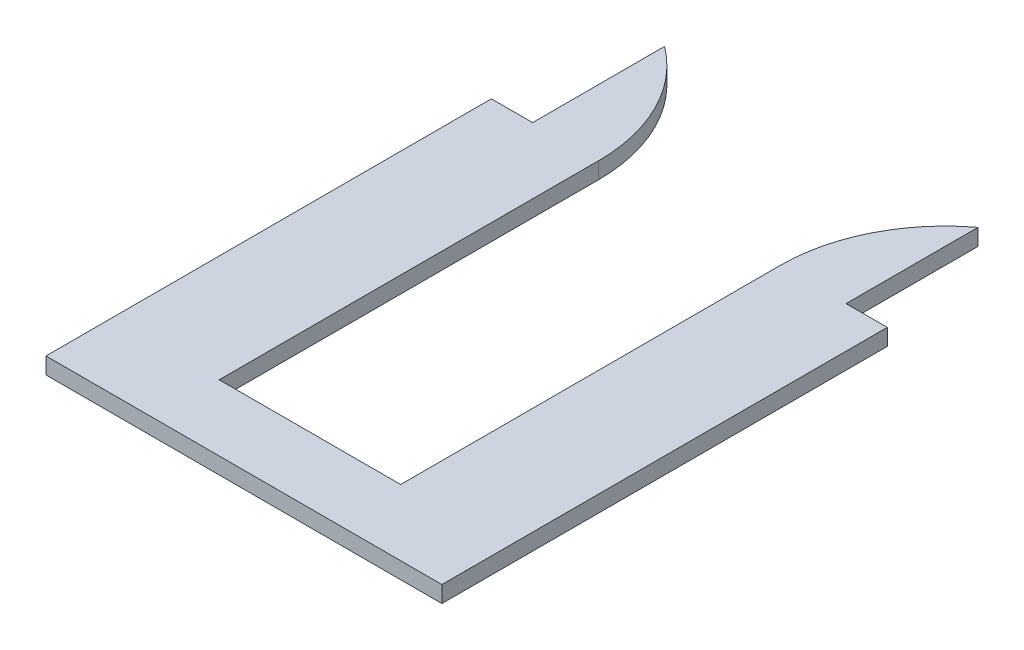
ISO-10303-21;
HEADER;
FILE_DESCRIPTION(('STEP AP214'),'2;1');
FILE_NAME('part.step','',(''),(''),'','','');
FILE_SCHEMA(('AUTOMOTIVE_DESIGN { 1 0 10303 214 1 1 1 1 }'));
ENDSEC;
DATA;
#1=APPLICATION_CONTEXT('core data for automotive mechanical design processes');
#2=APPLICATION_PROTOCOL_DEFINITION('international standard','automotive_design',2000,#1);
#3=PRODUCT_CONTEXT('',#1,'mechanical');
#4=PRODUCT('Part','Part','',(#3));
#5=PRODUCT_RELATED_PRODUCT_CATEGORY('part','',(#4));
#6=PRODUCT_DEFINITION_FORMATION('','',#4);
#7=PRODUCT_DEFINITION_CONTEXT('part definition',#1,'design');
#8=PRODUCT_DEFINITION('design','',#6,#7);
#9=PRODUCT_DEFINITION_SHAPE('','',#8);
#10=(LENGTH_UNIT() NAMED_UNIT(*) SI_UNIT(.MILLI.,.METRE.));
#11=(NAMED_UNIT(*) PLANE_ANGLE_UNIT() SI_UNIT($,.RADIAN.));
#12=(NAMED_UNIT(*) SI_UNIT($,.STERADIAN.) SOLID_ANGLE_UNIT());
#13=UNCERTAINTY_MEASURE_WITH_UNIT(LENGTH_MEASURE(1.E-05),#10,'distance_accuracy_value','');
#14=(GEOMETRIC_REPRESENTATION_CONTEXT(3) GLOBAL_UNCERTAINTY_ASSIGNED_CONTEXT((#13)) GLOBAL_UNIT_ASSIGNED_CONTEXT((#10,
#11,#12)) REPRESENTATION_CONTEXT('',''));
#15=CARTESIAN_POINT('',(0.,0.,0.));
#16=DIRECTION('',(0.,0.,1.));
#17=DIRECTION('',(1.,0.,0.));
#18=AXIS2_PLACEMENT_3D('',#15,#16,#17);
#19=CARTESIAN_POINT('',(0.,12.7,0.));
#20=DIRECTION('',(1.,0.,0.));
#21=DIRECTION('',(0.,0.,-1.));
#22=AXIS2_PLACEMENT_3D('',#19,#20,#21);
#23=PLANE('',#22);
#24=DIRECTION('',(0.,0.,1.));
#25=VECTOR('',#24,1.);
#26=CARTESIAN_POINT('',(0.,0.,0.));
#27=LINE('',#26,#25);
#28=CARTESIAN_POINT('',(0.,0.,-342.9));
#29=VERTEX_POINT('',#28);
#30=CARTESIAN_POINT('',(0.,0.,0.));
#31=VERTEX_POINT('',#30);
#32=EDGE_CURVE('E153',#29,#31,#27,.T.);
#33=ORIENTED_EDGE('',*,*,#32,.T.);
#34=DIRECTION('',(0.,-1.,0.));
#35=VECTOR('',#34,1.);
#36=CARTESIAN_POINT('',(0.,12.7,0.));
#37=LINE('',#36,#35);
#38=CARTESIAN_POINT('',(0.,12.7,0.));
#39=VERTEX_POINT('',#38);
#40=EDGE_CURVE('E11',#39,#31,#37,.T.);
#41=ORIENTED_EDGE('',*,*,#40,.F.);
#42=DIRECTION('',(0.,0.,1.));
#43=VECTOR('',#42,1.);
#44=CARTESIAN_POINT('',(0.,12.7,0.));
#45=LINE('',#44,#43);
#46=CARTESIAN_POINT('',(0.,12.7,-342.9));
#47=VERTEX_POINT('',#46);
#48=EDGE_CURVE('E175',#47,#39,#45,.T.);
#49=ORIENTED_EDGE('',*,*,#48,.F.);
#50=DIRECTION('',(0.,-1.,0.));
#51=VECTOR('',#50,1.);
#52=CARTESIAN_POINT('',(0.,12.7,-342.9));
#53=LINE('',#52,#51);
#54=EDGE_CURVE('E149',#47,#29,#53,.T.);
#55=ORIENTED_EDGE('',*,*,#54,.T.);
#56=EDGE_LOOP('',(#33,#41,#49,#55));
#57=FACE_BOUND('',#56,.T.);
#58=ADVANCED_FACE('F33',(#57),#23,.F.);
#59=CARTESIAN_POINT('',(0.,12.7,0.));
#60=DIRECTION('',(0.,0.,-1.));
#61=DIRECTION('',(-1.,0.,0.));
#62=AXIS2_PLACEMENT_3D('',#59,#60,#61);
#63=PLANE('',#62);
#64=DIRECTION('',(1.,0.,0.));
#65=VECTOR('',#64,1.);
#66=CARTESIAN_POINT('',(0.,0.,0.));
#67=LINE('',#66,#65);
#68=CARTESIAN_POINT('',(304.8,0.,0.));
#69=VERTEX_POINT('',#68);
#70=EDGE_CURVE('E156',#31,#69,#67,.T.);
#71=ORIENTED_EDGE('',*,*,#70,.T.);
#72=DIRECTION('',(0.,-1.,0.));
#73=VECTOR('',#72,1.);
#74=CARTESIAN_POINT('',(304.8,12.7,0.));
#75=LINE('',#74,#73);
#76=CARTESIAN_POINT('',(304.8,12.7,0.));
#77=VERTEX_POINT('',#76);
#78=EDGE_CURVE('E41',#77,#69,#75,.T.);
#79=ORIENTED_EDGE('',*,*,#78,.F.);
#80=DIRECTION('',(1.,0.,0.));
#81=VECTOR('',#80,1.);
#82=CARTESIAN_POINT('',(0.,12.7,0.));
#83=LINE('',#82,#81);
#84=EDGE_CURVE('E104',#39,#77,#83,.T.);
#85=ORIENTED_EDGE('',*,*,#84,.F.);
#86=ORIENTED_EDGE('',*,*,#40,.T.);
#87=EDGE_LOOP('',(#71,#79,#85,#86));
#88=FACE_BOUND('',#87,.T.);
#89=ADVANCED_FACE('F253',(#88),#63,.F.);
#90=CARTESIAN_POINT('',(304.8,12.7,0.));
#91=DIRECTION('',(-1.,0.,0.));
#92=DIRECTION('',(0.,0.,1.));
#93=AXIS2_PLACEMENT_3D('',#90,#91,#92);
#94=PLANE('',#93);
#95=DIRECTION('',(0.,0.,-1.));
#96=VECTOR('',#95,1.);
#97=CARTESIAN_POINT('',(304.8,0.,0.));
#98=LINE('',#97,#96);
#99=CARTESIAN_POINT('',(304.8,0.,-342.9));
#100=VERTEX_POINT('',#99);
#101=EDGE_CURVE('E158',#69,#100,#98,.T.);
#102=ORIENTED_EDGE('',*,*,#101,.T.);
#103=DIRECTION('',(0.,-1.,0.));
#104=VECTOR('',#103,1.);
#105=CARTESIAN_POINT('',(304.8,12.7,-342.9));
#106=LINE('',#105,#104);
#107=CARTESIAN_POINT('',(304.8,12.7,-342.9));
#108=VERTEX_POINT('',#107);
#109=EDGE_CURVE('E194',#108,#100,#106,.T.);
#110=ORIENTED_EDGE('',*,*,#109,.F.);
#111=DIRECTION('',(0.,0.,-1.));
#112=VECTOR('',#111,1.);
#113=CARTESIAN_POINT('',(304.8,12.7,0.));
#114=LINE('',#113,#112);
#115=EDGE_CURVE('E202',#77,#108,#114,.T.);
#116=ORIENTED_EDGE('',*,*,#115,.F.);
#117=ORIENTED_EDGE('',*,*,#78,.T.);
#118=EDGE_LOOP('',(#102,#110,#116,#117));
#119=FACE_BOUND('',#118,.T.);
#120=ADVANCED_FACE('F200',(#119),#94,.F.);
#121=CARTESIAN_POINT('',(304.8,12.7,-342.9));
#122=DIRECTION('',(0.,0.,1.));
#123=DIRECTION('',(1.,0.,0.));
#124=AXIS2_PLACEMENT_3D('',#121,#122,#123);
#125=PLANE('',#124);
#126=DIRECTION('',(-1.,0.,0.));
#127=VECTOR('',#126,1.);
#128=CARTESIAN_POINT('',(304.8,0.,-342.9));
#129=LINE('',#128,#127);
#130=CARTESIAN_POINT('',(273.05,0.,-342.9));
#131=VERTEX_POINT('',#130);
#132=EDGE_CURVE('E160',#100,#131,#129,.T.);
#133=ORIENTED_EDGE('',*,*,#132,.T.);
#134=DIRECTION('',(0.,-1.,0.));
#135=VECTOR('',#134,1.);
#136=CARTESIAN_POINT('',(273.05,12.7,-342.9));
#137=LINE('',#136,#135);
#138=CARTESIAN_POINT('',(273.05,12.7,-342.9));
#139=VERTEX_POINT('',#138);
#140=EDGE_CURVE('E191',#139,#131,#137,.T.);
#141=ORIENTED_EDGE('',*,*,#140,.F.);
#142=DIRECTION('',(-1.,0.,0.));
#143=VECTOR('',#142,1.);
#144=CARTESIAN_POINT('',(304.8,12.7,-342.9));
#145=LINE('',#144,#143);
#146=EDGE_CURVE('E220',#108,#139,#145,.T.);
#147=ORIENTED_EDGE('',*,*,#146,.F.);
#148=ORIENTED_EDGE('',*,*,#109,.T.);
#149=EDGE_LOOP('',(#133,#141,#147,#148));
#150=FACE_BOUND('',#149,.T.);
#151=ADVANCED_FACE('F211',(#150),#125,.F.);
#152=CARTESIAN_POINT('',(273.05,12.7,-342.9));
#153=DIRECTION('',(-1.,0.,0.));
#154=DIRECTION('',(0.,0.,1.));
#155=AXIS2_PLACEMENT_3D('',#152,#153,#154);
#156=PLANE('',#155);
#157=DIRECTION('',(0.,0.,-1.));
#158=VECTOR('',#157,1.);
#159=CARTESIAN_POINT('',(273.05,0.,-342.9));
#160=LINE('',#159,#158);
#161=CARTESIAN_POINT('',(273.05,0.,-444.5));
#162=VERTEX_POINT('',#161);
#163=EDGE_CURVE('E162',#131,#162,#160,.T.);
#164=ORIENTED_EDGE('',*,*,#163,.T.);
#165=DIRECTION('',(0.,-1.,0.));
#166=VECTOR('',#165,1.);
#167=CARTESIAN_POINT('',(273.05,12.7,-444.5));
#168=LINE('',#167,#166);
#169=CARTESIAN_POINT('',(273.05,12.7,-444.5));
#170=VERTEX_POINT('',#169);
#171=EDGE_CURVE('E188',#170,#162,#168,.T.);
#172=ORIENTED_EDGE('',*,*,#171,.F.);
#173=DIRECTION('',(0.,0.,-1.));
#174=VECTOR('',#173,1.);
#175=CARTESIAN_POINT('',(273.05,12.7,-342.9));
#176=LINE('',#175,#174);
#177=EDGE_CURVE('E217',#139,#170,#176,.T.);
#178=ORIENTED_EDGE('',*,*,#177,.F.);
#179=ORIENTED_EDGE('',*,*,#140,.T.);
#180=EDGE_LOOP('',(#164,#172,#178,#179));
#181=FACE_BOUND('',#180,.T.);
#182=ADVANCED_FACE('F215',(#181),#156,.F.);
#183=CARTESIAN_POINT('',(349.25,12.7,-342.9));
#184=DIRECTION('',(0.,-1.,0.));
#185=DIRECTION('',(0.,0.,-1.));
#186=AXIS2_PLACEMENT_3D('',#183,#184,#185);
#187=CYLINDRICAL_SURFACE('',#186,127.);
#188=CARTESIAN_POINT('',(349.25,0.,-342.9));
#189=DIRECTION('',(0.,1.,0.));
#190=DIRECTION('',(0.,0.,1.));
#191=AXIS2_PLACEMENT_3D('',#188,#189,#190);
#192=CIRCLE('',#191,127.);
#193=CARTESIAN_POINT('',(222.25,0.,-342.9));
#194=VERTEX_POINT('',#193);
#195=EDGE_CURVE('E164',#162,#194,#192,.T.);
#196=ORIENTED_EDGE('',*,*,#195,.T.);
#197=DIRECTION('',(0.,-1.,0.));
#198=VECTOR('',#197,1.);
#199=CARTESIAN_POINT('',(222.25,12.7,-342.9));
#200=LINE('',#199,#198);
#201=CARTESIAN_POINT('',(222.25,12.7,-342.9));
#202=VERTEX_POINT('',#201);
#203=EDGE_CURVE('E185',#202,#194,#200,.T.);
#204=ORIENTED_EDGE('',*,*,#203,.F.);
#205=CARTESIAN_POINT('',(349.25,12.7,-342.9));
#206=DIRECTION('',(0.,1.,0.));
#207=DIRECTION('',(0.,0.,1.));
#208=AXIS2_PLACEMENT_3D('',#205,#206,#207);
#209=CIRCLE('',#208,127.);
#210=EDGE_CURVE('E219',#170,#202,#209,.T.);
#211=ORIENTED_EDGE('',*,*,#210,.F.);
#212=ORIENTED_EDGE('',*,*,#171,.T.);
#213=EDGE_LOOP('',(#196,#204,#211,#212));
#214=FACE_BOUND('',#213,.T.);
#215=ADVANCED_FACE('F266',(#214),#187,.T.);
#216=CARTESIAN_POINT('',(222.25,12.7,-342.9));
#217=DIRECTION('',(1.,0.,0.));
#218=DIRECTION('',(0.,0.,-1.));
#219=AXIS2_PLACEMENT_3D('',#216,#217,#218);
#220=PLANE('',#219);
#221=DIRECTION('',(0.,0.,1.));
#222=VECTOR('',#221,1.);
#223=CARTESIAN_POINT('',(222.25,0.,-342.9));
#224=LINE('',#223,#222);
#225=CARTESIAN_POINT('',(222.25,0.,-50.8));
#226=VERTEX_POINT('',#225);
#227=EDGE_CURVE('E166',#194,#226,#224,.T.);
#228=ORIENTED_EDGE('',*,*,#227,.T.);
#229=DIRECTION('',(0.,-1.,0.));
#230=VECTOR('',#229,1.);
#231=CARTESIAN_POINT('',(222.25,12.7,-50.8));
#232=LINE('',#231,#230);
#233=CARTESIAN_POINT('',(222.25,12.7,-50.8));
#234=VERTEX_POINT('',#233);
#235=EDGE_CURVE('E182',#234,#226,#232,.T.);
#236=ORIENTED_EDGE('',*,*,#235,.F.);
#237=DIRECTION('',(0.,0.,1.));
#238=VECTOR('',#237,1.);
#239=CARTESIAN_POINT('',(222.25,12.7,-342.9));
#240=LINE('',#239,#238);
#241=EDGE_CURVE('E222',#202,#234,#240,.T.);
#242=ORIENTED_EDGE('',*,*,#241,.F.);
#243=ORIENTED_EDGE('',*,*,#203,.T.);
#244=EDGE_LOOP('',(#228,#236,#242,#243));
#245=FACE_BOUND('',#244,.T.);
#246=ADVANCED_FACE('F269',(#245),#220,.F.);
#247=CARTESIAN_POINT('',(82.55,12.7,-50.8));
#248=DIRECTION('',(0.,0.,1.));
#249=DIRECTION('',(1.,0.,0.));
#250=AXIS2_PLACEMENT_3D('',#247,#248,#249);
#251=PLANE('',#250);
#252=DIRECTION('',(-1.,0.,0.));
#253=VECTOR('',#252,1.);
#254=CARTESIAN_POINT('',(82.55,0.,-50.8));
#255=LINE('',#254,#253);
#256=CARTESIAN_POINT('',(82.55,0.,-50.8));
#257=VERTEX_POINT('',#256);
#258=EDGE_CURVE('E168',#226,#257,#255,.T.);
#259=ORIENTED_EDGE('',*,*,#258,.T.);
#260=DIRECTION('',(0.,-1.,0.));
#261=VECTOR('',#260,1.);
#262=CARTESIAN_POINT('',(82.55,12.7,-50.8));
#263=LINE('',#262,#261);
#264=CARTESIAN_POINT('',(82.55,12.7,-50.8));
#265=VERTEX_POINT('',#264);
#266=EDGE_CURVE('E179',#265,#257,#263,.T.);
#267=ORIENTED_EDGE('',*,*,#266,.F.);
#268=DIRECTION('',(-1.,0.,0.));
#269=VECTOR('',#268,1.);
#270=CARTESIAN_POINT('',(82.55,12.7,-50.8));
#271=LINE('',#270,#269);
#272=EDGE_CURVE('E228',#234,#265,#271,.T.);
#273=ORIENTED_EDGE('',*,*,#272,.F.);
#274=ORIENTED_EDGE('',*,*,#235,.T.);
#275=EDGE_LOOP('',(#259,#267,#273,#274));
#276=FACE_BOUND('',#275,.T.);
#277=ADVANCED_FACE('F234',(#276),#251,.F.);
#278=CARTESIAN_POINT('',(82.55,12.7,-342.9));
#279=DIRECTION('',(-1.,0.,0.));
#280=DIRECTION('',(0.,0.,1.));
#281=AXIS2_PLACEMENT_3D('',#278,#279,#280);
#282=PLANE('',#281);
#283=DIRECTION('',(0.,0.,-1.));
#284=VECTOR('',#283,1.);
#285=CARTESIAN_POINT('',(82.55,0.,-342.9));
#286=LINE('',#285,#284);
#287=CARTESIAN_POINT('',(82.55,0.,-342.9));
#288=VERTEX_POINT('',#287);
#289=EDGE_CURVE('E170',#257,#288,#286,.T.);
#290=ORIENTED_EDGE('',*,*,#289,.T.);
#291=DIRECTION('',(0.,-1.,0.));
#292=VECTOR('',#291,1.);
#293=CARTESIAN_POINT('',(82.55,12.7,-342.9));
#294=LINE('',#293,#292);
#295=CARTESIAN_POINT('',(82.55,12.7,-342.9));
#296=VERTEX_POINT('',#295);
#297=EDGE_CURVE('E144',#296,#288,#294,.T.);
#298=ORIENTED_EDGE('',*,*,#297,.F.);
#299=DIRECTION('',(0.,0.,-1.));
#300=VECTOR('',#299,1.);
#301=CARTESIAN_POINT('',(82.55,12.7,-342.9));
#302=LINE('',#301,#300);
#303=EDGE_CURVE('E135',#265,#296,#302,.T.);
#304=ORIENTED_EDGE('',*,*,#303,.F.);
#305=ORIENTED_EDGE('',*,*,#266,.T.);
#306=EDGE_LOOP('',(#290,#298,#304,#305));
#307=FACE_BOUND('',#306,.T.);
#308=ADVANCED_FACE('F238',(#307),#282,.F.);
#309=CARTESIAN_POINT('',(-44.4500000000001,12.7,-342.9));
#310=DIRECTION('',(0.,-1.,0.));
#311=DIRECTION('',(0.,0.,-1.));
#312=AXIS2_PLACEMENT_3D('',#309,#310,#311);
#313=CYLINDRICAL_SURFACE('',#312,127.);
#314=CARTESIAN_POINT('',(-44.4500000000001,0.,-342.9));
#315=DIRECTION('',(0.,1.,0.));
#316=DIRECTION('',(0.,0.,-1.));
#317=AXIS2_PLACEMENT_3D('',#314,#315,#316);
#318=CIRCLE('',#317,127.);
#319=CARTESIAN_POINT('',(31.75,0.,-444.5));
#320=VERTEX_POINT('',#319);
#321=EDGE_CURVE('E143',#288,#320,#318,.T.);
#322=ORIENTED_EDGE('',*,*,#321,.T.);
#323=DIRECTION('',(0.,-1.,0.));
#324=VECTOR('',#323,1.);
#325=CARTESIAN_POINT('',(31.75,12.7,-444.5));
#326=LINE('',#325,#324);
#327=CARTESIAN_POINT('',(31.75,12.7,-444.5));
#328=VERTEX_POINT('',#327);
#329=EDGE_CURVE('E140',#328,#320,#326,.T.);
#330=ORIENTED_EDGE('',*,*,#329,.F.);
#331=CARTESIAN_POINT('',(-44.4500000000001,12.7,-342.9));
#332=DIRECTION('',(0.,1.,0.));
#333=DIRECTION('',(0.,0.,-1.));
#334=AXIS2_PLACEMENT_3D('',#331,#332,#333);
#335=CIRCLE('',#334,127.);
#336=EDGE_CURVE('E129',#296,#328,#335,.T.);
#337=ORIENTED_EDGE('',*,*,#336,.F.);
#338=ORIENTED_EDGE('',*,*,#297,.T.);
#339=EDGE_LOOP('',(#322,#330,#337,#338));
#340=FACE_BOUND('',#339,.T.);
#341=ADVANCED_FACE('F141',(#340),#313,.T.);
#342=CARTESIAN_POINT('',(31.75,12.7,-342.9));
#343=DIRECTION('',(1.,0.,0.));
#344=DIRECTION('',(0.,0.,-1.));
#345=AXIS2_PLACEMENT_3D('',#342,#343,#344);
#346=PLANE('',#345);
#347=DIRECTION('',(0.,0.,1.));
#348=VECTOR('',#347,1.);
#349=CARTESIAN_POINT('',(31.75,0.,-342.9));
#350=LINE('',#349,#348);
#351=CARTESIAN_POINT('',(31.75,0.,-342.9));
#352=VERTEX_POINT('',#351);
#353=EDGE_CURVE('E90',#320,#352,#350,.T.);
#354=ORIENTED_EDGE('',*,*,#353,.T.);
#355=DIRECTION('',(0.,-1.,0.));
#356=VECTOR('',#355,1.);
#357=CARTESIAN_POINT('',(31.75,12.7,-342.9));
#358=LINE('',#357,#356);
#359=CARTESIAN_POINT('',(31.75,12.7,-342.9));
#360=VERTEX_POINT('',#359);
#361=EDGE_CURVE('E145',#360,#352,#358,.T.);
#362=ORIENTED_EDGE('',*,*,#361,.F.);
#363=DIRECTION('',(0.,0.,1.));
#364=VECTOR('',#363,1.);
#365=CARTESIAN_POINT('',(31.75,12.7,-342.9));
#366=LINE('',#365,#364);
#367=EDGE_CURVE('E133',#328,#360,#366,.T.);
#368=ORIENTED_EDGE('',*,*,#367,.F.);
#369=ORIENTED_EDGE('',*,*,#329,.T.);
#370=EDGE_LOOP('',(#354,#362,#368,#369));
#371=FACE_BOUND('',#370,.T.);
#372=ADVANCED_FACE('F147',(#371),#346,.F.);
#373=CARTESIAN_POINT('',(0.,12.7,-342.9));
#374=DIRECTION('',(0.,0.,1.));
#375=DIRECTION('',(1.,0.,0.));
#376=AXIS2_PLACEMENT_3D('',#373,#374,#375);
#377=PLANE('',#376);
#378=DIRECTION('',(-1.,0.,0.));
#379=VECTOR('',#378,1.);
#380=CARTESIAN_POINT('',(0.,0.,-342.9));
#381=LINE('',#380,#379);
#382=EDGE_CURVE('E96',#352,#29,#381,.T.);
#383=ORIENTED_EDGE('',*,*,#382,.T.);
#384=ORIENTED_EDGE('',*,*,#54,.F.);
#385=DIRECTION('',(-1.,0.,0.));
#386=VECTOR('',#385,1.);
#387=CARTESIAN_POINT('',(0.,12.7,-342.9));
#388=LINE('',#387,#386);
#389=EDGE_CURVE('E49',#360,#47,#388,.T.);
#390=ORIENTED_EDGE('',*,*,#389,.F.);
#391=ORIENTED_EDGE('',*,*,#361,.T.);
#392=EDGE_LOOP('',(#383,#384,#390,#391));
#393=FACE_BOUND('',#392,.T.);
#394=ADVANCED_FACE('F242',(#393),#377,.F.);
#395=CARTESIAN_POINT('',(-44.4500000000001,12.7,-342.9));
#396=DIRECTION('',(0.,-1.,0.));
#397=DIRECTION('',(0.,0.,-1.));
#398=AXIS2_PLACEMENT_3D('',#395,#396,#397);
#399=PLANE('',#398);
#400=ORIENTED_EDGE('',*,*,#48,.T.);
#401=ORIENTED_EDGE('',*,*,#84,.T.);
#402=ORIENTED_EDGE('',*,*,#115,.T.);
#403=ORIENTED_EDGE('',*,*,#146,.T.);
#404=ORIENTED_EDGE('',*,*,#177,.T.);
#405=ORIENTED_EDGE('',*,*,#210,.T.);
#406=ORIENTED_EDGE('',*,*,#241,.T.);
#407=ORIENTED_EDGE('',*,*,#272,.T.);
#408=ORIENTED_EDGE('',*,*,#303,.T.);
#409=ORIENTED_EDGE('',*,*,#336,.T.);
#410=ORIENTED_EDGE('',*,*,#367,.T.);
#411=ORIENTED_EDGE('',*,*,#389,.T.);
#412=EDGE_LOOP('',(#400,#401,#402,#403,#404,#405,#406,#407,#408,#409,#410,#411));
#413=FACE_BOUND('',#412,.T.);
#414=ADVANCED_FACE('F131',(#413),#399,.F.);
#415=CARTESIAN_POINT('',(-44.4500000000001,0.,-342.9));
#416=DIRECTION('',(0.,-1.,0.));
#417=DIRECTION('',(0.,0.,-1.));
#418=AXIS2_PLACEMENT_3D('',#415,#416,#417);
#419=PLANE('',#418);
#420=ORIENTED_EDGE('',*,*,#32,.F.);
#421=ORIENTED_EDGE('',*,*,#382,.F.);
#422=ORIENTED_EDGE('',*,*,#353,.F.);
#423=ORIENTED_EDGE('',*,*,#321,.F.);
#424=ORIENTED_EDGE('',*,*,#289,.F.);
#425=ORIENTED_EDGE('',*,*,#258,.F.);
#426=ORIENTED_EDGE('',*,*,#227,.F.);
#427=ORIENTED_EDGE('',*,*,#195,.F.);
#428=ORIENTED_EDGE('',*,*,#163,.F.);
#429=ORIENTED_EDGE('',*,*,#132,.F.);
#430=ORIENTED_EDGE('',*,*,#101,.F.);
#431=ORIENTED_EDGE('',*,*,#70,.F.);
#432=EDGE_LOOP('',(#420,#421,#422,#423,#424,#425,#426,#427,#428,#429,#430,#431));
#433=FACE_BOUND('',#432,.T.);
#434=ADVANCED_FACE('F206',(#433),#419,.T.);
#435=CLOSED_SHELL('',(#58,#89,#120,#151,#182,#215,#246,#277,#308,#341,#372,#394,#414,#434));
#436=MANIFOLD_SOLID_BREP('B2',#435);
#437=ADVANCED_BREP_SHAPE_REPRESENTATION('',(#18,#436),#14);
#438=SHAPE_DEFINITION_REPRESENTATION(#9,#437);
ENDSEC;
END-ISO-10303-21;
